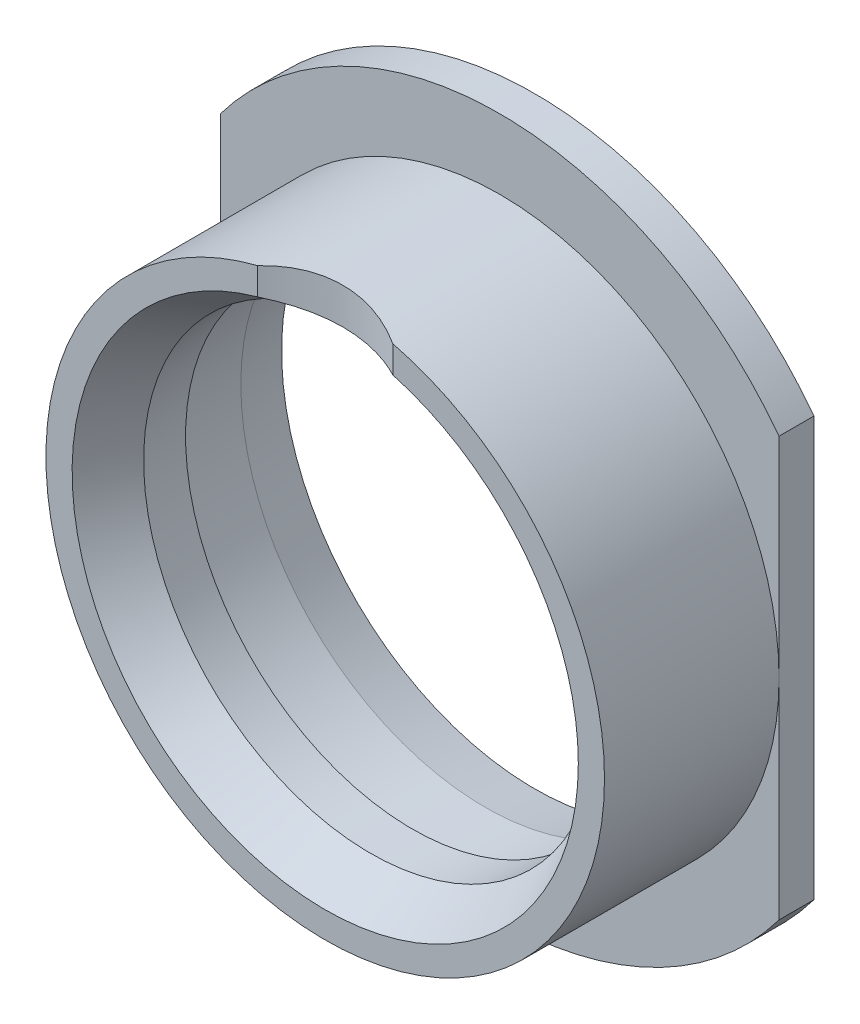
ISO-10303-21;
HEADER;
FILE_DESCRIPTION(('STEP AP214'),'2;1');
FILE_NAME('part.step','',(''),(''),'','','');
FILE_SCHEMA(('AUTOMOTIVE_DESIGN { 1 0 10303 214 1 1 1 1 }'));
ENDSEC;
DATA;
#1=APPLICATION_CONTEXT('core data for automotive mechanical design processes');
#2=APPLICATION_PROTOCOL_DEFINITION('international standard','automotive_design',2000,#1);
#3=PRODUCT_CONTEXT('',#1,'mechanical');
#4=PRODUCT('Part','Part','',(#3));
#5=PRODUCT_RELATED_PRODUCT_CATEGORY('part','',(#4));
#6=PRODUCT_DEFINITION_FORMATION('','',#4);
#7=PRODUCT_DEFINITION_CONTEXT('part definition',#1,'design');
#8=PRODUCT_DEFINITION('design','',#6,#7);
#9=PRODUCT_DEFINITION_SHAPE('','',#8);
#10=(LENGTH_UNIT() NAMED_UNIT(*) SI_UNIT(.MILLI.,.METRE.));
#11=(NAMED_UNIT(*) PLANE_ANGLE_UNIT() SI_UNIT($,.RADIAN.));
#12=(NAMED_UNIT(*) SI_UNIT($,.STERADIAN.) SOLID_ANGLE_UNIT());
#13=UNCERTAINTY_MEASURE_WITH_UNIT(LENGTH_MEASURE(1.E-05),#10,'distance_accuracy_value','');
#14=(GEOMETRIC_REPRESENTATION_CONTEXT(3) GLOBAL_UNCERTAINTY_ASSIGNED_CONTEXT((#13)) GLOBAL_UNIT_ASSIGNED_CONTEXT((#10,
#11,#12)) REPRESENTATION_CONTEXT('',''));
#15=CARTESIAN_POINT('',(0.,0.,0.));
#16=DIRECTION('',(0.,0.,1.));
#17=DIRECTION('',(1.,0.,0.));
#18=AXIS2_PLACEMENT_3D('',#15,#16,#17);
#19=CARTESIAN_POINT('',(0.,0.,0.));
#20=DIRECTION('',(0.,0.,1.));
#21=DIRECTION('',(1.,0.,0.));
#22=AXIS2_PLACEMENT_3D('',#19,#20,#21);
#23=CYLINDRICAL_SURFACE('',#22,16.);
#24=CARTESIAN_POINT('',(0.,0.,-10.));
#25=DIRECTION('',(0.,0.,1.));
#26=DIRECTION('',(1.,0.,0.));
#27=AXIS2_PLACEMENT_3D('',#24,#25,#26);
#28=CIRCLE('',#27,16.);
#29=CARTESIAN_POINT('',(-16.,0.,-10.));
#30=VERTEX_POINT('',#29);
#31=CARTESIAN_POINT('',(16.,0.,-10.));
#32=VERTEX_POINT('',#31);
#33=EDGE_CURVE('E151',#30,#32,#28,.T.);
#34=ORIENTED_EDGE('',*,*,#33,.T.);
#35=EDGE_CURVE('E153',#32,#30,#28,.T.);
#36=ORIENTED_EDGE('',*,*,#35,.T.);
#37=EDGE_LOOP('',(#34,#36));
#38=FACE_BOUND('',#37,.T.);
#39=CARTESIAN_POINT('',(3.87298334620742,15.52417469626,0.));
#40=CARTESIAN_POINT('',(3.69367571293611,15.5689309807894,-0.0992272179762844));
#41=CARTESIAN_POINT('',(3.51007329233805,15.6114145535678,-0.191792827869808));
#42=CARTESIAN_POINT('',(3.13523940949025,15.6909786290891,-0.362925274833926));
#43=CARTESIAN_POINT('',(2.9440048277492,15.7280568931075,-0.441486314596204));
#44=CARTESIAN_POINT('',(2.55484143679982,15.7959449128909,-0.58391517139139));
#45=CARTESIAN_POINT('',(2.35690674146296,15.8267489807775,-0.647769662984537));
#46=CARTESIAN_POINT('',(1.95578151121344,15.8813055171289,-0.760043940464631));
#47=CARTESIAN_POINT('',(1.75259177399506,15.9050590490861,-0.808466054229446));
#48=CARTESIAN_POINT('',(1.34172416005068,15.9449834821284,-0.889470410419527));
#49=CARTESIAN_POINT('',(1.13403506019308,15.9611323886242,-0.922006716759284));
#50=CARTESIAN_POINT('',(0.716271397123872,15.9853285423517,-0.970644604342715));
#51=CARTESIAN_POINT('',(0.506196867350191,15.9933759030061,-0.986746415671166));
#52=CARTESIAN_POINT('',(0.0854691881568233,16.0011538064021,-1.00231019559928));
#53=CARTESIAN_POINT('',(-0.125183260756278,16.0008919107839,-1.00178729312172));
#54=CARTESIAN_POINT('',(-0.545603659480633,15.9920767684139,-0.984145426243285));
#55=CARTESIAN_POINT('',(-0.755371669199714,15.9835240926064,-0.967027604651093));
#56=CARTESIAN_POINT('',(-1.16424166531751,15.9588482494661,-0.917403512583899));
#57=CARTESIAN_POINT('',(-1.36343937282177,15.943035057764,-0.88552691530254));
#58=CARTESIAN_POINT('',(-1.7581998090264,15.9043411107484,-0.806998975018788));
#59=CARTESIAN_POINT('',(-1.95376251912477,15.8814603192772,-0.760347556428674));
#60=CARTESIAN_POINT('',(-2.339923199113,15.8291729601208,-0.652772275615886));
#61=CARTESIAN_POINT('',(-2.53052323052526,15.7997691520634,-0.591854448335882));
#62=CARTESIAN_POINT('',(-2.9056844241836,15.7350948296668,-0.456323060823732));
#63=CARTESIAN_POINT('',(-3.09024801893998,15.6998267142186,-0.381715099478408));
#64=CARTESIAN_POINT('',(-3.37403482776315,15.6405535119341,-0.254555023328667));
#65=CARTESIAN_POINT('',(-3.47563176014305,15.6182774516375,-0.206426626861759));
#66=CARTESIAN_POINT('',(-3.676227944739,15.572280459379,-0.106186790330704));
#67=CARTESIAN_POINT('',(-3.77523223693148,15.5485626832141,-0.0540839903665342));
#68=CARTESIAN_POINT('',(-3.87298334620743,15.52417469626,0.));
#69=B_SPLINE_CURVE_WITH_KNOTS('',3,(#39,#40,#41,#42,#43,#44,#45,#46,#47,#48,#49,#50,#51,#52,#53,
#54,#55,#56,#57,#58,#59,#60,#61,#62,#63,#64,#65,#66,#67,#68),.UNSPECIFIED.,.F.,.F.,(4,2,2,2,2,2,
2,2,2,2,2,2,2,2,4),(0.,0.629180367013392,1.25862058669478,1.88862891087272,2.51854215719872,
3.15026625624125,3.78198151095405,4.41312190479251,5.04421883825108,5.65057141296194,
6.25692708981179,6.86302672934925,7.46887904111516,7.81260061506064,8.15559516257296),.UNSPECIFIED.);
#70=CARTESIAN_POINT('',(3.87298334620742,15.52417469626,0.));
#71=VERTEX_POINT('',#70);
#72=CARTESIAN_POINT('',(-3.87298334620742,15.52417469626,0.));
#73=VERTEX_POINT('',#72);
#74=EDGE_CURVE('E57',#71,#73,#69,.T.);
#75=ORIENTED_EDGE('',*,*,#74,.F.);
#76=CARTESIAN_POINT('',(0.,0.,0.));
#77=DIRECTION('',(0.,0.,1.));
#78=DIRECTION('',(1.,0.,0.));
#79=AXIS2_PLACEMENT_3D('',#76,#77,#78);
#80=CIRCLE('',#79,16.);
#81=EDGE_CURVE('E97',#73,#71,#80,.T.);
#82=ORIENTED_EDGE('',*,*,#81,.F.);
#83=EDGE_LOOP('',(#75,#82));
#84=FACE_BOUND('',#83,.T.);
#85=ADVANCED_FACE('F31',(#38,#84),#23,.T.);
#86=CARTESIAN_POINT('',(0.,16.,0.));
#87=DIRECTION('',(0.,0.,-1.));
#88=DIRECTION('',(-1.,0.,0.));
#89=AXIS2_PLACEMENT_3D('',#86,#87,#88);
#90=PLANE('',#89);
#91=DIRECTION('',(0.,1.,0.));
#92=VECTOR('',#91,1.);
#93=CARTESIAN_POINT('',(-3.87298334620742,0.,0.));
#94=LINE('',#93,#92);
#95=CARTESIAN_POINT('',(-3.87298334620742,13.9731886124821,0.));
#96=VERTEX_POINT('',#95);
#97=EDGE_CURVE('E51',#96,#73,#94,.T.);
#98=ORIENTED_EDGE('',*,*,#97,.T.);
#99=ORIENTED_EDGE('',*,*,#81,.T.);
#100=DIRECTION('',(0.,1.,0.));
#101=VECTOR('',#100,1.);
#102=CARTESIAN_POINT('',(3.87298334620742,0.,0.));
#103=LINE('',#102,#101);
#104=CARTESIAN_POINT('',(3.87298334620742,13.9731886124821,0.));
#105=VERTEX_POINT('',#104);
#106=EDGE_CURVE('E101',#105,#71,#103,.T.);
#107=ORIENTED_EDGE('',*,*,#106,.F.);
#108=CARTESIAN_POINT('',(0.,0.,0.));
#109=DIRECTION('',(0.,0.,1.));
#110=DIRECTION('',(1.,0.,0.));
#111=AXIS2_PLACEMENT_3D('',#108,#109,#110);
#112=CIRCLE('',#111,14.5);
#113=EDGE_CURVE('E94',#96,#105,#112,.T.);
#114=ORIENTED_EDGE('',*,*,#113,.F.);
#115=EDGE_LOOP('',(#98,#99,#107,#114));
#116=FACE_BOUND('',#115,.T.);
#117=ADVANCED_FACE('F102',(#116),#90,.F.);
#118=CARTESIAN_POINT('',(0.,0.,0.));
#119=DIRECTION('',(0.,0.,1.));
#120=DIRECTION('',(1.,0.,0.));
#121=AXIS2_PLACEMENT_3D('',#118,#119,#120);
#122=CONICAL_SURFACE('',#121,14.5,0.5235987755983);
#123=CARTESIAN_POINT('',(0.,0.,-2.59807621135331));
#124=DIRECTION('',(0.,0.,1.));
#125=DIRECTION('',(1.,0.,0.));
#126=AXIS2_PLACEMENT_3D('',#123,#124,#125);
#127=CIRCLE('',#126,13.);
#128=CARTESIAN_POINT('',(13.,0.,-2.59807621135331));
#129=VERTEX_POINT('',#128);
#130=EDGE_CURVE('E98',#129,#129,#127,.T.);
#131=ORIENTED_EDGE('',*,*,#130,.F.);
#132=EDGE_LOOP('',(#131));
#133=FACE_BOUND('',#132,.T.);
#134=CARTESIAN_POINT('',(-4.04879734736132,13.9834992449033,0.100200000000001));
#135=CARTESIAN_POINT('',(-3.8560711149982,13.971348269903,-0.0129260350236244));
#136=CARTESIAN_POINT('',(-3.65847744710963,13.9618307853772,-0.117983896507887));
#137=CARTESIAN_POINT('',(-3.25510662029983,13.9467845262869,-0.311234911052994));
#138=CARTESIAN_POINT('',(-3.04933110392859,13.9412549553508,-0.399431428675297));
#139=CARTESIAN_POINT('',(-2.63135516153011,13.9329081200635,-0.558168764636715));
#140=CARTESIAN_POINT('',(-2.41916388691529,13.930087164487,-0.628733513701753));
#141=CARTESIAN_POINT('',(-1.98960252890522,13.9260971704241,-0.751863961373932));
#142=CARTESIAN_POINT('',(-1.77223231476509,13.9249281736873,-0.804429205058617));
#143=CARTESIAN_POINT('',(-1.33389271214721,13.9234256698409,-0.891174871170123));
#144=CARTESIAN_POINT('',(-1.11292397843025,13.9230920124115,-0.925358600495516));
#145=CARTESIAN_POINT('',(-0.66890078555726,13.9227179901414,-0.975116251232642));
#146=CARTESIAN_POINT('',(-0.445846324253184,13.9226776256029,-0.990690153476426));
#147=CARTESIAN_POINT('',(0.000916311836898944,13.9226397498181,-1.00312231578225));
#148=CARTESIAN_POINT('',(0.224624796161359,13.9226422640337,-0.999969456424397));
#149=CARTESIAN_POINT('',(0.670983871584631,13.9227411745814,-0.974944787925497));
#150=CARTESIAN_POINT('',(0.893634500951556,13.922837567491,-0.953073661186466));
#151=CARTESIAN_POINT('',(1.33793442544774,13.9234770028484,-0.890540282054762));
#152=CARTESIAN_POINT('',(1.55956463836076,13.924023290996,-0.849742422597275));
#153=CARTESIAN_POINT('',(1.9986321990161,13.9262198081804,-0.749592026876433));
#154=CARTESIAN_POINT('',(2.21606879774332,13.9278702325806,-0.690236207997718));
#155=CARTESIAN_POINT('',(2.64470070618028,13.9331935577638,-0.553546786820635));
#156=CARTESIAN_POINT('',(2.85590765556618,13.9368623968498,-0.476249468563619));
#157=CARTESIAN_POINT('',(3.27090475362668,13.9473676870444,-0.304216348178709));
#158=CARTESIAN_POINT('',(3.47469969284796,13.9542020515039,-0.209492058307593));
#159=CARTESIAN_POINT('',(3.73743525138236,13.9661644762127,-0.0736613357460671));
#160=CARTESIAN_POINT('',(3.8004084171228,13.9692792295237,-0.0400279979894355));
#161=CARTESIAN_POINT('',(3.92534876355074,13.9760052540469,0.0288654481245775));
#162=CARTESIAN_POINT('',(3.98731689268324,13.9796160225213,0.0641238856135996));
#163=CARTESIAN_POINT('',(4.04879734736132,13.9834992449033,0.1002));
#164=B_SPLINE_CURVE_WITH_KNOTS('',3,(#134,#135,#136,#137,#138,#139,#140,#141,#142,#143,#144,
#145,#146,#147,#148,#149,#150,#151,#152,#153,#154,#155,#156,#157,#158,#159,#160,#161,#162,#163),
.UNSPECIFIED.,.F.,.F.,(4,2,2,2,2,2,2,2,2,2,2,2,2,2,4),(0.,0.671161213587053,1.34218836161385,
2.01229974922632,2.6824280720942,3.35243579616981,4.02244421034651,4.69285049627129,
5.3632323425884,6.03849336407996,6.71387389641851,7.38790029176416,8.06148301375501,
8.27584337169225,8.48998804528536),.UNSPECIFIED.);
#165=EDGE_CURVE('E11',#96,#105,#164,.T.);
#166=ORIENTED_EDGE('',*,*,#165,.F.);
#167=ORIENTED_EDGE('',*,*,#113,.T.);
#168=EDGE_LOOP('',(#166,#167));
#169=FACE_BOUND('',#168,.T.);
#170=ADVANCED_FACE('F96',(#133,#169),#122,.F.);
#171=CARTESIAN_POINT('',(0.,0.,0.));
#172=DIRECTION('',(0.,0.,1.));
#173=DIRECTION('',(1.,0.,0.));
#174=AXIS2_PLACEMENT_3D('',#171,#172,#173);
#175=CYLINDRICAL_SURFACE('',#174,20.);
#176=CARTESIAN_POINT('',(0.,0.,-12.));
#177=DIRECTION('',(0.,0.,1.));
#178=DIRECTION('',(1.,0.,0.));
#179=AXIS2_PLACEMENT_3D('',#176,#177,#178);
#180=CIRCLE('',#179,20.);
#181=CARTESIAN_POINT('',(-16.,-12.,-12.));
#182=VERTEX_POINT('',#181);
#183=CARTESIAN_POINT('',(16.,-12.,-12.));
#184=VERTEX_POINT('',#183);
#185=EDGE_CURVE('E166',#182,#184,#180,.T.);
#186=ORIENTED_EDGE('',*,*,#185,.T.);
#187=DIRECTION('',(0.,0.,1.));
#188=VECTOR('',#187,1.);
#189=CARTESIAN_POINT('',(16.,-12.,-12.));
#190=LINE('',#189,#188);
#191=CARTESIAN_POINT('',(16.,-12.,-10.));
#192=VERTEX_POINT('',#191);
#193=EDGE_CURVE('E205',#184,#192,#190,.T.);
#194=ORIENTED_EDGE('',*,*,#193,.T.);
#195=CARTESIAN_POINT('',(0.,0.,-10.));
#196=DIRECTION('',(0.,0.,1.));
#197=DIRECTION('',(1.,0.,0.));
#198=AXIS2_PLACEMENT_3D('',#195,#196,#197);
#199=CIRCLE('',#198,20.);
#200=CARTESIAN_POINT('',(-16.,-12.,-10.));
#201=VERTEX_POINT('',#200);
#202=EDGE_CURVE('E160',#201,#192,#199,.T.);
#203=ORIENTED_EDGE('',*,*,#202,.F.);
#204=DIRECTION('',(0.,0.,1.));
#205=VECTOR('',#204,1.);
#206=CARTESIAN_POINT('',(-16.,-12.,-12.));
#207=LINE('',#206,#205);
#208=EDGE_CURVE('E194',#182,#201,#207,.T.);
#209=ORIENTED_EDGE('',*,*,#208,.F.);
#210=EDGE_LOOP('',(#186,#194,#203,#209));
#211=FACE_BOUND('',#210,.T.);
#212=ADVANCED_FACE('F140',(#211),#175,.T.);
#213=CARTESIAN_POINT('',(0.,20.,-10.));
#214=DIRECTION('',(0.,0.,-1.));
#215=DIRECTION('',(-1.,0.,0.));
#216=AXIS2_PLACEMENT_3D('',#213,#214,#215);
#217=PLANE('',#216);
#218=ORIENTED_EDGE('',*,*,#202,.T.);
#219=DIRECTION('',(0.,1.,0.));
#220=VECTOR('',#219,1.);
#221=CARTESIAN_POINT('',(16.,20.,-10.));
#222=LINE('',#221,#220);
#223=EDGE_CURVE('E201',#192,#32,#222,.T.);
#224=ORIENTED_EDGE('',*,*,#223,.T.);
#225=ORIENTED_EDGE('',*,*,#33,.F.);
#226=DIRECTION('',(0.,1.,0.));
#227=VECTOR('',#226,1.);
#228=CARTESIAN_POINT('',(-16.,20.,-10.));
#229=LINE('',#228,#227);
#230=EDGE_CURVE('E182',#201,#30,#229,.T.);
#231=ORIENTED_EDGE('',*,*,#230,.F.);
#232=EDGE_LOOP('',(#218,#224,#225,#231));
#233=FACE_BOUND('',#232,.T.);
#234=ADVANCED_FACE('F213',(#233),#217,.F.);
#235=CARTESIAN_POINT('',(0.,14.5,-12.));
#236=DIRECTION('',(0.,0.,1.));
#237=DIRECTION('',(1.,0.,0.));
#238=AXIS2_PLACEMENT_3D('',#235,#236,#237);
#239=PLANE('',#238);
#240=CARTESIAN_POINT('',(0.,0.,-12.));
#241=DIRECTION('',(0.,0.,1.));
#242=DIRECTION('',(1.,0.,0.));
#243=AXIS2_PLACEMENT_3D('',#240,#241,#242);
#244=CIRCLE('',#243,14.5);
#245=CARTESIAN_POINT('',(14.5,0.,-12.));
#246=VERTEX_POINT('',#245);
#247=EDGE_CURVE('E169',#246,#246,#244,.T.);
#248=ORIENTED_EDGE('',*,*,#247,.T.);
#249=EDGE_LOOP('',(#248));
#250=FACE_BOUND('',#249,.T.);
#251=CARTESIAN_POINT('',(16.,12.,-12.));
#252=VERTEX_POINT('',#251);
#253=CARTESIAN_POINT('',(-16.,12.,-12.));
#254=VERTEX_POINT('',#253);
#255=EDGE_CURVE('E165',#252,#254,#180,.T.);
#256=ORIENTED_EDGE('',*,*,#255,.F.);
#257=DIRECTION('',(0.,-1.,0.));
#258=VECTOR('',#257,1.);
#259=CARTESIAN_POINT('',(16.,-44.1414213562373,-12.));
#260=LINE('',#259,#258);
#261=EDGE_CURVE('E113',#252,#184,#260,.T.);
#262=ORIENTED_EDGE('',*,*,#261,.T.);
#263=ORIENTED_EDGE('',*,*,#185,.F.);
#264=DIRECTION('',(0.,-1.,0.));
#265=VECTOR('',#264,1.);
#266=CARTESIAN_POINT('',(-16.,-44.1414213562373,-12.));
#267=LINE('',#266,#265);
#268=EDGE_CURVE('E198',#254,#182,#267,.T.);
#269=ORIENTED_EDGE('',*,*,#268,.F.);
#270=EDGE_LOOP('',(#256,#262,#263,#269));
#271=FACE_BOUND('',#270,.T.);
#272=ADVANCED_FACE('F224',(#250,#271),#239,.F.);
#273=CARTESIAN_POINT('',(16.,12.,-10.));
#274=VERTEX_POINT('',#273);
#275=CARTESIAN_POINT('',(-16.,12.,-10.));
#276=VERTEX_POINT('',#275);
#277=EDGE_CURVE('E158',#274,#276,#199,.T.);
#278=ORIENTED_EDGE('',*,*,#277,.F.);
#279=DIRECTION('',(0.,0.,1.));
#280=VECTOR('',#279,1.);
#281=CARTESIAN_POINT('',(16.,12.,-12.));
#282=LINE('',#281,#280);
#283=EDGE_CURVE('E206',#252,#274,#282,.T.);
#284=ORIENTED_EDGE('',*,*,#283,.F.);
#285=ORIENTED_EDGE('',*,*,#255,.T.);
#286=DIRECTION('',(0.,0.,1.));
#287=VECTOR('',#286,1.);
#288=CARTESIAN_POINT('',(-16.,12.,-12.));
#289=LINE('',#288,#287);
#290=EDGE_CURVE('E195',#254,#276,#289,.T.);
#291=ORIENTED_EDGE('',*,*,#290,.T.);
#292=EDGE_LOOP('',(#278,#284,#285,#291));
#293=FACE_BOUND('',#292,.T.);
#294=ADVANCED_FACE('F220',(#293),#175,.T.);
#295=ORIENTED_EDGE('',*,*,#35,.F.);
#296=EDGE_CURVE('E202',#32,#274,#222,.T.);
#297=ORIENTED_EDGE('',*,*,#296,.T.);
#298=ORIENTED_EDGE('',*,*,#277,.T.);
#299=EDGE_CURVE('E186',#30,#276,#229,.T.);
#300=ORIENTED_EDGE('',*,*,#299,.F.);
#301=EDGE_LOOP('',(#295,#297,#298,#300));
#302=FACE_BOUND('',#301,.T.);
#303=ADVANCED_FACE('F177',(#302),#217,.F.);
#304=CARTESIAN_POINT('',(0.,0.,0.));
#305=DIRECTION('',(0.,0.,1.));
#306=DIRECTION('',(1.,0.,0.));
#307=AXIS2_PLACEMENT_3D('',#304,#305,#306);
#308=CYLINDRICAL_SURFACE('',#307,14.);
#309=CARTESIAN_POINT('',(0.,0.,-9.16435909019115));
#310=DIRECTION('',(0.,0.,1.));
#311=DIRECTION('',(1.,0.,0.));
#312=AXIS2_PLACEMENT_3D('',#309,#310,#311);
#313=CIRCLE('',#312,14.);
#314=CARTESIAN_POINT('',(14.,0.,-9.16435909019115));
#315=VERTEX_POINT('',#314);
#316=EDGE_CURVE('E44',#315,#315,#313,.T.);
#317=ORIENTED_EDGE('',*,*,#316,.F.);
#318=EDGE_LOOP('',(#317));
#319=FACE_BOUND('',#318,.T.);
#320=CARTESIAN_POINT('',(0.,0.,-5.));
#321=DIRECTION('',(0.,0.,1.));
#322=DIRECTION('',(1.,0.,0.));
#323=AXIS2_PLACEMENT_3D('',#320,#321,#322);
#324=CIRCLE('',#323,14.);
#325=CARTESIAN_POINT('',(14.,0.,-5.));
#326=VERTEX_POINT('',#325);
#327=EDGE_CURVE('E180',#326,#326,#324,.T.);
#328=ORIENTED_EDGE('',*,*,#327,.T.);
#329=EDGE_LOOP('',(#328));
#330=FACE_BOUND('',#329,.T.);
#331=ADVANCED_FACE('F33',(#319,#330),#308,.F.);
#332=CARTESIAN_POINT('',(0.,0.,-9.16435909019115));
#333=DIRECTION('',(0.,0.,-1.));
#334=DIRECTION('',(-1.,0.,0.));
#335=AXIS2_PLACEMENT_3D('',#332,#333,#334);
#336=CONICAL_SURFACE('',#335,14.,0.174532925199433);
#337=ORIENTED_EDGE('',*,*,#247,.F.);
#338=EDGE_LOOP('',(#337));
#339=FACE_BOUND('',#338,.T.);
#340=ORIENTED_EDGE('',*,*,#316,.T.);
#341=EDGE_LOOP('',(#340));
#342=FACE_BOUND('',#341,.T.);
#343=ADVANCED_FACE('F136',(#339,#342),#336,.F.);
#344=CARTESIAN_POINT('',(0.,0.,0.));
#345=DIRECTION('',(0.,0.,1.));
#346=DIRECTION('',(1.,0.,0.));
#347=AXIS2_PLACEMENT_3D('',#344,#345,#346);
#348=CYLINDRICAL_SURFACE('',#347,13.);
#349=CARTESIAN_POINT('',(0.,0.,-5.));
#350=DIRECTION('',(0.,0.,1.));
#351=DIRECTION('',(1.,0.,0.));
#352=AXIS2_PLACEMENT_3D('',#349,#350,#351);
#353=CIRCLE('',#352,13.);
#354=CARTESIAN_POINT('',(13.,0.,-5.));
#355=VERTEX_POINT('',#354);
#356=EDGE_CURVE('E181',#355,#355,#353,.T.);
#357=ORIENTED_EDGE('',*,*,#356,.F.);
#358=EDGE_LOOP('',(#357));
#359=FACE_BOUND('',#358,.T.);
#360=ORIENTED_EDGE('',*,*,#130,.T.);
#361=EDGE_LOOP('',(#360));
#362=FACE_BOUND('',#361,.T.);
#363=ADVANCED_FACE('F133',(#359,#362),#348,.F.);
#364=CARTESIAN_POINT('',(0.,13.,-5.));
#365=DIRECTION('',(0.,0.,1.));
#366=DIRECTION('',(1.,0.,0.));
#367=AXIS2_PLACEMENT_3D('',#364,#365,#366);
#368=PLANE('',#367);
#369=ORIENTED_EDGE('',*,*,#327,.F.);
#370=EDGE_LOOP('',(#369));
#371=FACE_BOUND('',#370,.T.);
#372=ORIENTED_EDGE('',*,*,#356,.T.);
#373=EDGE_LOOP('',(#372));
#374=FACE_BOUND('',#373,.T.);
#375=ADVANCED_FACE('F129',(#371,#374),#368,.F.);
#376=CARTESIAN_POINT('',(-16.,-44.1414213562373,-12.));
#377=DIRECTION('',(-1.,0.,0.));
#378=DIRECTION('',(0.,0.,1.));
#379=AXIS2_PLACEMENT_3D('',#376,#377,#378);
#380=PLANE('',#379);
#381=ORIENTED_EDGE('',*,*,#230,.T.);
#382=ORIENTED_EDGE('',*,*,#299,.T.);
#383=ORIENTED_EDGE('',*,*,#290,.F.);
#384=ORIENTED_EDGE('',*,*,#268,.T.);
#385=ORIENTED_EDGE('',*,*,#208,.T.);
#386=EDGE_LOOP('',(#381,#382,#383,#384,#385));
#387=FACE_BOUND('',#386,.T.);
#388=ADVANCED_FACE('F125',(#387),#380,.T.);
#389=CARTESIAN_POINT('',(16.,-44.1414213562373,-12.));
#390=DIRECTION('',(-1.,0.,0.));
#391=DIRECTION('',(0.,0.,1.));
#392=AXIS2_PLACEMENT_3D('',#389,#390,#391);
#393=PLANE('',#392);
#394=ORIENTED_EDGE('',*,*,#193,.F.);
#395=ORIENTED_EDGE('',*,*,#261,.F.);
#396=ORIENTED_EDGE('',*,*,#283,.T.);
#397=ORIENTED_EDGE('',*,*,#296,.F.);
#398=ORIENTED_EDGE('',*,*,#223,.F.);
#399=EDGE_LOOP('',(#394,#395,#396,#397,#398));
#400=FACE_BOUND('',#399,.T.);
#401=ADVANCED_FACE('F121',(#400),#393,.F.);
#402=CARTESIAN_POINT('',(0.,0.,7.));
#403=DIRECTION('',(0.,1.,0.));
#404=DIRECTION('',(0.,0.,1.));
#405=AXIS2_PLACEMENT_3D('',#402,#403,#404);
#406=CYLINDRICAL_SURFACE('',#405,8.);
#407=ORIENTED_EDGE('',*,*,#106,.T.);
#408=ORIENTED_EDGE('',*,*,#74,.T.);
#409=ORIENTED_EDGE('',*,*,#97,.F.);
#410=ORIENTED_EDGE('',*,*,#165,.T.);
#411=EDGE_LOOP('',(#407,#408,#409,#410));
#412=FACE_BOUND('',#411,.T.);
#413=ADVANCED_FACE('F105',(#412),#406,.F.);
#414=CLOSED_SHELL('',(#85,#117,#170,#212,#234,#272,#294,#303,#331,#343,#363,#375,#388,#401,#413));
#415=MANIFOLD_SOLID_BREP('B2',#414);
#416=ADVANCED_BREP_SHAPE_REPRESENTATION('',(#18,#415),#14);
#417=SHAPE_DEFINITION_REPRESENTATION(#9,#416);
ENDSEC;
END-ISO-10303-21;
